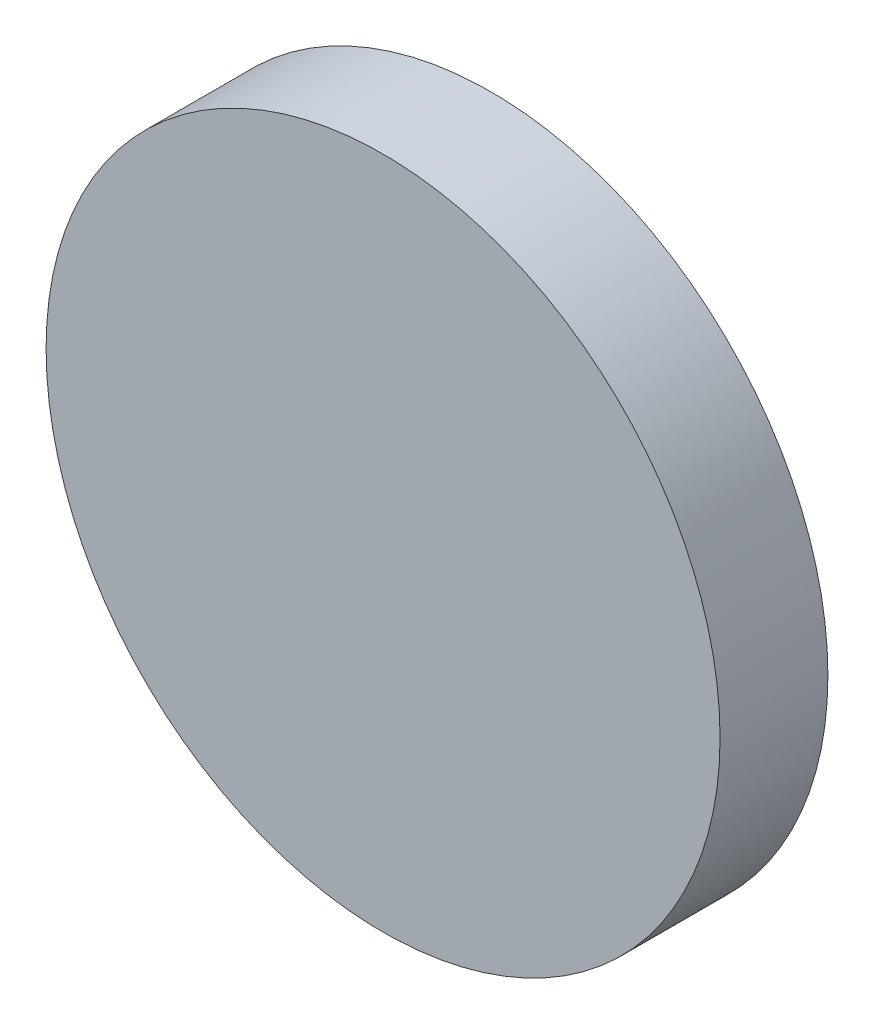
ISO-10303-21;
HEADER;
FILE_DESCRIPTION(('STEP AP214'),'2;1');
FILE_NAME('part.step','',(''),(''),'','','');
FILE_SCHEMA(('AUTOMOTIVE_DESIGN { 1 0 10303 214 1 1 1 1 }'));
ENDSEC;
DATA;
#1=APPLICATION_CONTEXT('core data for automotive mechanical design processes');
#2=APPLICATION_PROTOCOL_DEFINITION('international standard','automotive_design',2000,#1);
#3=PRODUCT_CONTEXT('',#1,'mechanical');
#4=PRODUCT('Part','Part','',(#3));
#5=PRODUCT_RELATED_PRODUCT_CATEGORY('part','',(#4));
#6=PRODUCT_DEFINITION_FORMATION('','',#4);
#7=PRODUCT_DEFINITION_CONTEXT('part definition',#1,'design');
#8=PRODUCT_DEFINITION('design','',#6,#7);
#9=PRODUCT_DEFINITION_SHAPE('','',#8);
#10=(LENGTH_UNIT() NAMED_UNIT(*) SI_UNIT(.MILLI.,.METRE.));
#11=(NAMED_UNIT(*) PLANE_ANGLE_UNIT() SI_UNIT($,.RADIAN.));
#12=(NAMED_UNIT(*) SI_UNIT($,.STERADIAN.) SOLID_ANGLE_UNIT());
#13=UNCERTAINTY_MEASURE_WITH_UNIT(LENGTH_MEASURE(1.E-05),#10,'distance_accuracy_value','');
#14=(GEOMETRIC_REPRESENTATION_CONTEXT(3) GLOBAL_UNCERTAINTY_ASSIGNED_CONTEXT((#13)) GLOBAL_UNIT_ASSIGNED_CONTEXT((#10,
#11,#12)) REPRESENTATION_CONTEXT('',''));
#15=CARTESIAN_POINT('',(0.,0.,0.));
#16=DIRECTION('',(0.,0.,1.));
#17=DIRECTION('',(1.,0.,0.));
#18=AXIS2_PLACEMENT_3D('',#15,#16,#17);
#19=CARTESIAN_POINT('',(0.,0.,0.));
#20=DIRECTION('',(0.,0.,1.));
#21=DIRECTION('',(1.,0.,0.));
#22=AXIS2_PLACEMENT_3D('',#19,#20,#21);
#23=PLANE('',#22);
#24=CARTESIAN_POINT('',(0.,0.,0.));
#25=DIRECTION('',(0.,0.,-1.));
#26=DIRECTION('',(-1.,0.,0.));
#27=AXIS2_PLACEMENT_3D('',#24,#25,#26);
#28=CIRCLE('',#27,6.25);
#29=CARTESIAN_POINT('',(-6.25,0.,0.));
#30=VERTEX_POINT('',#29);
#31=EDGE_CURVE('E18',#30,#30,#28,.F.);
#32=ORIENTED_EDGE('',*,*,#31,.F.);
#33=EDGE_LOOP('',(#32));
#34=FACE_BOUND('',#33,.T.);
#35=ADVANCED_FACE('F15',(#34),#23,.F.);
#36=CARTESIAN_POINT('',(0.,0.,2.));
#37=DIRECTION('',(0.,0.,-1.));
#38=DIRECTION('',(-1.,0.,0.));
#39=AXIS2_PLACEMENT_3D('',#36,#37,#38);
#40=CYLINDRICAL_SURFACE('',#39,6.25);
#41=ORIENTED_EDGE('',*,*,#31,.T.);
#42=EDGE_LOOP('',(#41));
#43=FACE_BOUND('',#42,.T.);
#44=CARTESIAN_POINT('',(0.,0.,2.));
#45=DIRECTION('',(0.,0.,-1.));
#46=DIRECTION('',(-1.,0.,0.));
#47=AXIS2_PLACEMENT_3D('',#44,#45,#46);
#48=CIRCLE('',#47,6.25);
#49=CARTESIAN_POINT('',(-6.25,0.,2.));
#50=VERTEX_POINT('',#49);
#51=EDGE_CURVE('E9',#50,#50,#48,.F.);
#52=ORIENTED_EDGE('',*,*,#51,.F.);
#53=EDGE_LOOP('',(#52));
#54=FACE_BOUND('',#53,.T.);
#55=ADVANCED_FACE('F27',(#43,#54),#40,.T.);
#56=CARTESIAN_POINT('',(0.,0.,2.));
#57=DIRECTION('',(0.,0.,1.));
#58=DIRECTION('',(1.,0.,0.));
#59=AXIS2_PLACEMENT_3D('',#56,#57,#58);
#60=PLANE('',#59);
#61=ORIENTED_EDGE('',*,*,#51,.T.);
#62=EDGE_LOOP('',(#61));
#63=FACE_BOUND('',#62,.T.);
#64=ADVANCED_FACE('F34',(#63),#60,.T.);
#65=CLOSED_SHELL('',(#35,#55,#64));
#66=MANIFOLD_SOLID_BREP('B1',#65);
#67=ADVANCED_BREP_SHAPE_REPRESENTATION('',(#18,#66),#14);
#68=SHAPE_DEFINITION_REPRESENTATION(#9,#67);
ENDSEC;
END-ISO-10303-21;
